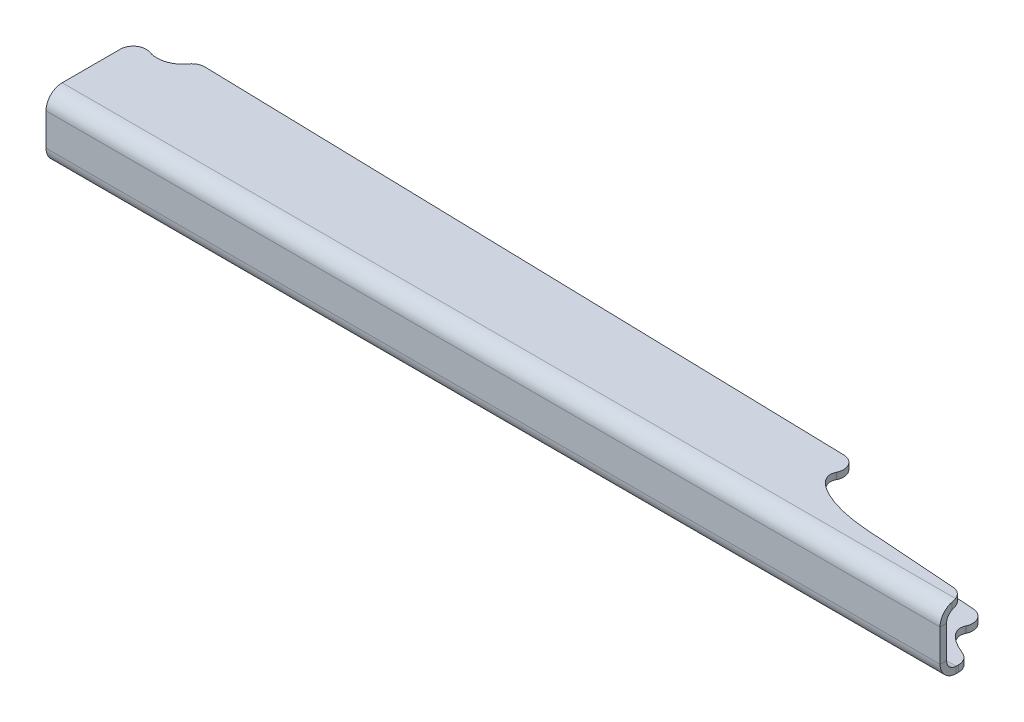
ISO-10303-21;
HEADER;
FILE_DESCRIPTION(('STEP AP214'),'2;1');
FILE_NAME('part.step','',(''),(''),'','','');
FILE_SCHEMA(('AUTOMOTIVE_DESIGN { 1 0 10303 214 1 1 1 1 }'));
ENDSEC;
DATA;
#1=APPLICATION_CONTEXT('core data for automotive mechanical design processes');
#2=APPLICATION_PROTOCOL_DEFINITION('international standard','automotive_design',2000,#1);
#3=PRODUCT_CONTEXT('',#1,'mechanical');
#4=PRODUCT('Part','Part','',(#3));
#5=PRODUCT_RELATED_PRODUCT_CATEGORY('part','',(#4));
#6=PRODUCT_DEFINITION_FORMATION('','',#4);
#7=PRODUCT_DEFINITION_CONTEXT('part definition',#1,'design');
#8=PRODUCT_DEFINITION('design','',#6,#7);
#9=PRODUCT_DEFINITION_SHAPE('','',#8);
#10=(LENGTH_UNIT() NAMED_UNIT(*) SI_UNIT(.MILLI.,.METRE.));
#11=(NAMED_UNIT(*) PLANE_ANGLE_UNIT() SI_UNIT($,.RADIAN.));
#12=(NAMED_UNIT(*) SI_UNIT($,.STERADIAN.) SOLID_ANGLE_UNIT());
#13=UNCERTAINTY_MEASURE_WITH_UNIT(LENGTH_MEASURE(1.E-05),#10,'distance_accuracy_value','');
#14=(GEOMETRIC_REPRESENTATION_CONTEXT(3) GLOBAL_UNCERTAINTY_ASSIGNED_CONTEXT((#13)) GLOBAL_UNIT_ASSIGNED_CONTEXT((#10,
#11,#12)) REPRESENTATION_CONTEXT('',''));
#15=CARTESIAN_POINT('',(0.,0.,0.));
#16=DIRECTION('',(0.,0.,1.));
#17=DIRECTION('',(1.,0.,0.));
#18=AXIS2_PLACEMENT_3D('',#15,#16,#17);
#19=CARTESIAN_POINT('',(176.197711918843,15.8750000000001,226.870352333592));
#20=DIRECTION('',(0.,-1.,0.));
#21=DIRECTION('',(0.997546498443055,0.,0.0700070242475666));
#22=AXIS2_PLACEMENT_3D('',#19,#20,#21);
#23=ELLIPSE('',#22,33.0952528110335,12.7);
#24=DIRECTION('',(0.,-1.,0.));
#25=VECTOR('',#24,1.);
#26=SURFACE_OF_LINEAR_EXTRUSION('',#23,#25);
#27=CARTESIAN_POINT('',(175.308622710899,15.875,239.539186009303));
#28=VERTEX_POINT('',#27);
#29=CARTESIAN_POINT('',(175.260174515592,15.875,239.535785953276));
#30=VERTEX_POINT('',#29);
#31=EDGE_CURVE('E291',#28,#30,#23,.T.);
#32=ORIENTED_EDGE('',*,*,#31,.F.);
#33=DIRECTION('',(0.,-1.,0.));
#34=VECTOR('',#33,1.);
#35=CARTESIAN_POINT('',(175.308622710899,15.875,239.539192863819));
#36=LINE('',#35,#34);
#37=CARTESIAN_POINT('',(175.308622710899,12.7,239.539192863819));
#38=VERTEX_POINT('',#37);
#39=EDGE_CURVE('E287',#28,#38,#36,.T.);
#40=ORIENTED_EDGE('',*,*,#39,.T.);
#41=CARTESIAN_POINT('',(176.197711918843,12.7000000000001,226.870352333592));
#42=DIRECTION('',(0.,-1.,0.));
#43=DIRECTION('',(0.997546498443055,0.,0.0700070242475666));
#44=AXIS2_PLACEMENT_3D('',#41,#42,#43);
#45=ELLIPSE('',#44,33.0952528110335,12.7);
#46=CARTESIAN_POINT('',(175.260174515592,12.7,239.535785953276));
#47=VERTEX_POINT('',#46);
#48=EDGE_CURVE('E296',#38,#47,#45,.T.);
#49=ORIENTED_EDGE('',*,*,#48,.T.);
#50=CARTESIAN_POINT('',(175.260174998121,12.7,239.535779132623));
#51=DIRECTION('',(0.,1.,0.));
#52=VECTOR('',#51,1.);
#53=LINE('',#50,#52);
#54=EDGE_CURVE('E336',#47,#30,#53,.T.);
#55=ORIENTED_EDGE('',*,*,#54,.T.);
#56=EDGE_LOOP('',(#32,#40,#49,#55));
#57=FACE_BOUND('',#56,.T.);
#58=ADVANCED_FACE('F44',(#57),#26,.F.);
#59=CARTESIAN_POINT('',(219.384237005619,-15.875,251.23487255075));
#60=DIRECTION('',(-1.,0.,0.));
#61=DIRECTION('',(0.,0.,1.));
#62=AXIS2_PLACEMENT_3D('',#59,#60,#61);
#63=PLANE('',#62);
#64=DIRECTION('',(0.,0.,1.));
#65=VECTOR('',#64,1.);
#66=CARTESIAN_POINT('',(219.384237005619,-15.875,251.23487255075));
#67=LINE('',#66,#65);
#68=CARTESIAN_POINT('',(219.384237005619,-15.875,245.310356735731));
#69=VERTEX_POINT('',#68);
#70=CARTESIAN_POINT('',(219.384237005619,-15.875,246.47237255075));
#71=VERTEX_POINT('',#70);
#72=EDGE_CURVE('E375',#69,#71,#67,.T.);
#73=ORIENTED_EDGE('',*,*,#72,.F.);
#74=DIRECTION('',(0.,1.,0.));
#75=VECTOR('',#74,1.);
#76=CARTESIAN_POINT('',(219.384237005619,-12.7,245.310356735731));
#77=LINE('',#76,#75);
#78=CARTESIAN_POINT('',(219.384237005619,-12.7,245.310356735731));
#79=VERTEX_POINT('',#78);
#80=EDGE_CURVE('E567',#69,#79,#77,.T.);
#81=ORIENTED_EDGE('',*,*,#80,.T.);
#82=DIRECTION('',(0.,0.,1.));
#83=VECTOR('',#82,1.);
#84=CARTESIAN_POINT('',(219.384237005619,-12.7,251.23487255075));
#85=LINE('',#84,#83);
#86=CARTESIAN_POINT('',(219.384237005619,-12.7,246.47237255075));
#87=VERTEX_POINT('',#86);
#88=EDGE_CURVE('E248',#79,#87,#85,.T.);
#89=ORIENTED_EDGE('',*,*,#88,.T.);
#90=DIRECTION('',(0.,-1.,0.));
#91=VECTOR('',#90,1.);
#92=CARTESIAN_POINT('',(219.384237005619,-12.7,246.47237255075));
#93=LINE('',#92,#91);
#94=EDGE_CURVE('E362',#87,#71,#93,.T.);
#95=ORIENTED_EDGE('',*,*,#94,.T.);
#96=EDGE_LOOP('',(#73,#81,#89,#95));
#97=FACE_BOUND('',#96,.T.);
#98=ADVANCED_FACE('F312',(#97),#63,.F.);
#99=CARTESIAN_POINT('',(0.,0.,254.40987255075));
#100=DIRECTION('',(0.,0.,-1.));
#101=DIRECTION('',(-1.,0.,0.));
#102=AXIS2_PLACEMENT_3D('',#99,#100,#101);
#103=PLANE('',#102);
#104=DIRECTION('',(-1.,0.,0.));
#105=VECTOR('',#104,1.);
#106=CARTESIAN_POINT('',(-219.384237005619,-7.93750000000003,254.40987255075));
#107=LINE('',#106,#105);
#108=CARTESIAN_POINT('',(-219.384237005619,-7.93750000000003,254.40987255075));
#109=VERTEX_POINT('',#108);
#110=CARTESIAN_POINT('',(219.384237005619,-7.93750000000003,254.40987255075));
#111=VERTEX_POINT('',#110);
#112=EDGE_CURVE('E381',#109,#111,#107,.F.);
#113=ORIENTED_EDGE('',*,*,#112,.T.);
#114=DIRECTION('',(0.,1.,0.));
#115=VECTOR('',#114,1.);
#116=CARTESIAN_POINT('',(219.384237005619,-12.7,254.40987255075));
#117=LINE('',#116,#115);
#118=CARTESIAN_POINT('',(219.384237005619,7.93750000000003,254.40987255075));
#119=VERTEX_POINT('',#118);
#120=EDGE_CURVE('E290',#111,#119,#117,.T.);
#121=ORIENTED_EDGE('',*,*,#120,.T.);
#122=DIRECTION('',(1.,0.,0.));
#123=VECTOR('',#122,1.);
#124=CARTESIAN_POINT('',(219.384237005619,7.93750000000003,254.40987255075));
#125=LINE('',#124,#123);
#126=CARTESIAN_POINT('',(-219.384237005619,7.93750000000003,254.40987255075));
#127=VERTEX_POINT('',#126);
#128=EDGE_CURVE('E417',#119,#127,#125,.F.);
#129=ORIENTED_EDGE('',*,*,#128,.T.);
#130=DIRECTION('',(0.,-1.,0.));
#131=VECTOR('',#130,1.);
#132=CARTESIAN_POINT('',(-219.384237005619,-12.7,254.40987255075));
#133=LINE('',#132,#131);
#134=EDGE_CURVE('E438',#127,#109,#133,.T.);
#135=ORIENTED_EDGE('',*,*,#134,.T.);
#136=EDGE_LOOP('',(#113,#121,#129,#135));
#137=FACE_BOUND('',#136,.T.);
#138=ADVANCED_FACE('F517',(#137),#103,.F.);
#139=CARTESIAN_POINT('',(0.,0.,251.23487255075));
#140=DIRECTION('',(0.,0.,-1.));
#141=DIRECTION('',(-1.,0.,0.));
#142=AXIS2_PLACEMENT_3D('',#139,#140,#141);
#143=PLANE('',#142);
#144=DIRECTION('',(0.,1.,0.));
#145=VECTOR('',#144,1.);
#146=CARTESIAN_POINT('',(219.384237005619,0.,251.23487255075));
#147=LINE('',#146,#145);
#148=CARTESIAN_POINT('',(219.384237005619,-7.93750000000003,251.23487255075));
#149=VERTEX_POINT('',#148);
#150=CARTESIAN_POINT('',(219.384237005619,7.93750000000003,251.23487255075));
#151=VERTEX_POINT('',#150);
#152=EDGE_CURVE('E440',#149,#151,#147,.T.);
#153=ORIENTED_EDGE('',*,*,#152,.F.);
#154=DIRECTION('',(-1.,0.,0.));
#155=VECTOR('',#154,1.);
#156=CARTESIAN_POINT('',(-219.384237005619,-7.93750000000003,251.23487255075));
#157=LINE('',#156,#155);
#158=CARTESIAN_POINT('',(-219.384237005619,-7.93750000000003,251.23487255075));
#159=VERTEX_POINT('',#158);
#160=EDGE_CURVE('E393',#159,#149,#157,.F.);
#161=ORIENTED_EDGE('',*,*,#160,.F.);
#162=DIRECTION('',(0.,1.,0.));
#163=VECTOR('',#162,1.);
#164=CARTESIAN_POINT('',(-219.384237005619,0.,251.23487255075));
#165=LINE('',#164,#163);
#166=CARTESIAN_POINT('',(-219.384237005619,7.93750000000003,251.23487255075));
#167=VERTEX_POINT('',#166);
#168=EDGE_CURVE('E435',#167,#159,#165,.F.);
#169=ORIENTED_EDGE('',*,*,#168,.F.);
#170=DIRECTION('',(1.,0.,0.));
#171=VECTOR('',#170,1.);
#172=CARTESIAN_POINT('',(219.384237005619,7.93750000000003,251.23487255075));
#173=LINE('',#172,#171);
#174=EDGE_CURVE('E428',#151,#167,#173,.F.);
#175=ORIENTED_EDGE('',*,*,#174,.F.);
#176=EDGE_LOOP('',(#153,#161,#169,#175));
#177=FACE_BOUND('',#176,.T.);
#178=ADVANCED_FACE('F453',(#177),#143,.T.);
#179=CARTESIAN_POINT('',(-219.384237005619,-12.7,254.40987255075));
#180=DIRECTION('',(1.,0.,0.));
#181=DIRECTION('',(0.,-1.,0.));
#182=AXIS2_PLACEMENT_3D('',#179,#180,#181);
#183=PLANE('',#182);
#184=ORIENTED_EDGE('',*,*,#168,.T.);
#185=DIRECTION('',(0.,0.,1.));
#186=VECTOR('',#185,1.);
#187=CARTESIAN_POINT('',(-219.384237005619,-7.93750000000003,251.23487255075));
#188=LINE('',#187,#186);
#189=EDGE_CURVE('E387',#159,#109,#188,.T.);
#190=ORIENTED_EDGE('',*,*,#189,.T.);
#191=ORIENTED_EDGE('',*,*,#134,.F.);
#192=DIRECTION('',(0.,0.,1.));
#193=VECTOR('',#192,1.);
#194=CARTESIAN_POINT('',(-219.384237005619,7.93750000000003,251.23487255075));
#195=LINE('',#194,#193);
#196=EDGE_CURVE('E432',#167,#127,#195,.T.);
#197=ORIENTED_EDGE('',*,*,#196,.F.);
#198=EDGE_LOOP('',(#184,#190,#191,#197));
#199=FACE_BOUND('',#198,.T.);
#200=ADVANCED_FACE('F523',(#199),#183,.F.);
#201=CARTESIAN_POINT('',(219.384237005619,-12.7,254.40987255075));
#202=DIRECTION('',(-1.,0.,0.));
#203=DIRECTION('',(0.,1.,0.));
#204=AXIS2_PLACEMENT_3D('',#201,#202,#203);
#205=PLANE('',#204);
#206=DIRECTION('',(0.,0.,1.));
#207=VECTOR('',#206,1.);
#208=CARTESIAN_POINT('',(219.384237005619,-7.93750000000003,251.23487255075));
#209=LINE('',#208,#207);
#210=EDGE_CURVE('E398',#149,#111,#209,.T.);
#211=ORIENTED_EDGE('',*,*,#210,.F.);
#212=ORIENTED_EDGE('',*,*,#152,.T.);
#213=DIRECTION('',(0.,0.,1.));
#214=VECTOR('',#213,1.);
#215=CARTESIAN_POINT('',(219.384237005619,7.93750000000003,251.23487255075));
#216=LINE('',#215,#214);
#217=EDGE_CURVE('E423',#151,#119,#216,.T.);
#218=ORIENTED_EDGE('',*,*,#217,.T.);
#219=ORIENTED_EDGE('',*,*,#120,.F.);
#220=EDGE_LOOP('',(#211,#212,#218,#219));
#221=FACE_BOUND('',#220,.T.);
#222=ADVANCED_FACE('F448',(#221),#205,.F.);
#223=CARTESIAN_POINT('',(-219.384237005619,7.93750000000003,246.47237255075));
#224=DIRECTION('',(-1.,0.,0.));
#225=DIRECTION('',(0.,0.,1.));
#226=AXIS2_PLACEMENT_3D('',#223,#224,#225);
#227=PLANE('',#226);
#228=DIRECTION('',(0.,1.,0.));
#229=VECTOR('',#228,1.);
#230=CARTESIAN_POINT('',(-219.384237005619,12.7,246.47237255075));
#231=LINE('',#230,#229);
#232=CARTESIAN_POINT('',(-219.384237005619,12.7,246.47237255075));
#233=VERTEX_POINT('',#232);
#234=CARTESIAN_POINT('',(-219.384237005619,15.875,246.47237255075));
#235=VERTEX_POINT('',#234);
#236=EDGE_CURVE('E401',#233,#235,#231,.T.);
#237=ORIENTED_EDGE('',*,*,#236,.F.);
#238=CARTESIAN_POINT('',(-219.384237005619,7.93750000000003,246.47237255075));
#239=DIRECTION('',(1.,0.,0.));
#240=DIRECTION('',(0.,0.,-1.));
#241=AXIS2_PLACEMENT_3D('',#238,#239,#240);
#242=CIRCLE('',#241,4.76249999999999);
#243=EDGE_CURVE('E425',#167,#233,#242,.F.);
#244=ORIENTED_EDGE('',*,*,#243,.F.);
#245=ORIENTED_EDGE('',*,*,#196,.T.);
#246=CARTESIAN_POINT('',(-219.384237005619,7.93750000000003,246.47237255075));
#247=DIRECTION('',(1.,0.,0.));
#248=DIRECTION('',(0.,0.,-1.));
#249=AXIS2_PLACEMENT_3D('',#246,#247,#248);
#250=CIRCLE('',#249,7.93749999999999);
#251=EDGE_CURVE('E419',#127,#235,#250,.F.);
#252=ORIENTED_EDGE('',*,*,#251,.T.);
#253=EDGE_LOOP('',(#237,#244,#245,#252));
#254=FACE_BOUND('',#253,.T.);
#255=ADVANCED_FACE('F511',(#254),#227,.T.);
#256=CARTESIAN_POINT('',(219.384237005619,7.93750000000003,246.47237255075));
#257=DIRECTION('',(-1.,0.,0.));
#258=DIRECTION('',(0.,0.,1.));
#259=AXIS2_PLACEMENT_3D('',#256,#257,#258);
#260=PLANE('',#259);
#261=CARTESIAN_POINT('',(219.384237005619,7.93750000000003,246.47237255075));
#262=DIRECTION('',(1.,0.,0.));
#263=DIRECTION('',(0.,0.,-1.));
#264=AXIS2_PLACEMENT_3D('',#261,#262,#263);
#265=CIRCLE('',#264,4.76249999999999);
#266=CARTESIAN_POINT('',(219.384237005619,12.2217814411415,248.552357835095));
#267=VERTEX_POINT('',#266);
#268=EDGE_CURVE('E415',#267,#151,#265,.T.);
#269=ORIENTED_EDGE('',*,*,#268,.F.);
#270=DIRECTION('',(0.,-1.,0.));
#271=VECTOR('',#270,1.);
#272=CARTESIAN_POINT('',(219.384237005619,15.8750000000001,248.552357835095));
#273=LINE('',#272,#271);
#274=CARTESIAN_POINT('',(219.384237005619,15.5976284236565,248.552357835095));
#275=VERTEX_POINT('',#274);
#276=EDGE_CURVE('E461',#267,#275,#273,.F.);
#277=ORIENTED_EDGE('',*,*,#276,.T.);
#278=CARTESIAN_POINT('',(219.384237005619,7.93750000000003,246.47237255075));
#279=DIRECTION('',(1.,0.,0.));
#280=DIRECTION('',(0.,0.,-1.));
#281=AXIS2_PLACEMENT_3D('',#278,#279,#280);
#282=CIRCLE('',#281,7.93749999999999);
#283=EDGE_CURVE('E420',#275,#119,#282,.T.);
#284=ORIENTED_EDGE('',*,*,#283,.T.);
#285=ORIENTED_EDGE('',*,*,#217,.F.);
#286=EDGE_LOOP('',(#269,#277,#284,#285));
#287=FACE_BOUND('',#286,.T.);
#288=ADVANCED_FACE('F458',(#287),#260,.F.);
#289=CARTESIAN_POINT('',(219.384237005619,7.93750000000003,246.47237255075));
#290=DIRECTION('',(1.,0.,0.));
#291=DIRECTION('',(0.,1.,0.));
#292=AXIS2_PLACEMENT_3D('',#289,#290,#291);
#293=CYLINDRICAL_SURFACE('',#292,7.93749999999999);
#294=ORIENTED_EDGE('',*,*,#283,.F.);
#295=CARTESIAN_POINT('',(219.384237005619,15.5976284236565,248.552357835095));
#296=CARTESIAN_POINT('',(219.384264996326,15.6352887334146,248.41377608777));
#297=CARTESIAN_POINT('',(219.379701384491,15.6691364681828,248.274141636719));
#298=CARTESIAN_POINT('',(219.361174167291,15.7291422309625,247.99377112524));
#299=CARTESIAN_POINT('',(219.347205534562,15.7552961355601,247.853034515451));
#300=CARTESIAN_POINT('',(219.30998073337,15.7994183835176,247.574084964663));
#301=CARTESIAN_POINT('',(219.286891963162,15.8175224020565,247.435871105136));
#302=CARTESIAN_POINT('',(219.231433570082,15.8463143043339,247.160618676665));
#303=CARTESIAN_POINT('',(219.199070138114,15.8570071188834,247.023579386322));
#304=CARTESIAN_POINT('',(219.143204458094,15.867782266984,246.817929678283));
#305=CARTESIAN_POINT('',(219.123069399117,15.8704959599045,246.748515919373));
#306=CARTESIAN_POINT('',(219.08032979249,15.8741093359709,246.610056270426));
#307=CARTESIAN_POINT('',(219.057714353504,15.8750006512596,246.541013522791));
#308=CARTESIAN_POINT('',(219.0339170985,15.875,246.47237255075));
#309=B_SPLINE_CURVE_WITH_KNOTS('',3,(#295,#296,#297,#298,#299,#300,#301,#302,#303,#304,#305,
#306,#307,#308),.UNSPECIFIED.,.F.,.F.,(4,2,2,2,2,2,4),(0.,0.430722182565064,0.861674786593532,
1.28505978139482,1.70816281923735,1.92508435726537,2.14299972258811),.UNSPECIFIED.);
#310=CARTESIAN_POINT('',(219.0339170985,15.875,246.47237255075));
#311=VERTEX_POINT('',#310);
#312=EDGE_CURVE('E466',#275,#311,#309,.T.);
#313=ORIENTED_EDGE('',*,*,#312,.T.);
#314=DIRECTION('',(-1.,0.,0.));
#315=VECTOR('',#314,1.);
#316=CARTESIAN_POINT('',(0.,15.875,246.47237255075));
#317=LINE('',#316,#315);
#318=EDGE_CURVE('E407',#311,#235,#317,.T.);
#319=ORIENTED_EDGE('',*,*,#318,.T.);
#320=ORIENTED_EDGE('',*,*,#251,.F.);
#321=ORIENTED_EDGE('',*,*,#128,.F.);
#322=EDGE_LOOP('',(#294,#313,#319,#320,#321));
#323=FACE_BOUND('',#322,.T.);
#324=ADVANCED_FACE('F465',(#323),#293,.T.);
#325=CARTESIAN_POINT('',(219.384237005619,7.93750000000003,246.47237255075));
#326=DIRECTION('',(1.,0.,0.));
#327=DIRECTION('',(0.,1.,0.));
#328=AXIS2_PLACEMENT_3D('',#325,#326,#327);
#329=CYLINDRICAL_SURFACE('',#328,4.76249999999999);
#330=DIRECTION('',(1.,0.,0.));
#331=VECTOR('',#330,1.);
#332=CARTESIAN_POINT('',(-219.384237005619,12.7,246.47237255075));
#333=LINE('',#332,#331);
#334=CARTESIAN_POINT('',(219.0339170985,12.7,246.47237255075));
#335=VERTEX_POINT('',#334);
#336=EDGE_CURVE('E404',#233,#335,#333,.T.);
#337=ORIENTED_EDGE('',*,*,#336,.T.);
#338=CARTESIAN_POINT('',(219.0339170985,12.7,246.47237255075));
#339=CARTESIAN_POINT('',(219.07068558409,12.7000201432615,246.578361826147));
#340=CARTESIAN_POINT('',(219.104608748737,12.696462145525,246.685355313597));
#341=CARTESIAN_POINT('',(219.166652497087,12.6819336044352,246.900556063539));
#342=CARTESIAN_POINT('',(219.194770905764,12.6709602891416,247.00876376504));
#343=CARTESIAN_POINT('',(219.244482385859,12.6416878266099,247.223004664771));
#344=CARTESIAN_POINT('',(219.266211650407,12.6235644545484,247.329030102591));
#345=CARTESIAN_POINT('',(219.304021131823,12.5799297723705,247.540506015227));
#346=CARTESIAN_POINT('',(219.320103660699,12.5544214937665,247.645956707915));
#347=CARTESIAN_POINT('',(219.350747382918,12.4873056902437,247.886794660234));
#348=CARTESIAN_POINT('',(219.363425493606,12.4431657039896,248.021734033288));
#349=CARTESIAN_POINT('',(219.376003785007,12.367527890703,248.222080444876));
#350=CARTESIAN_POINT('',(219.379121815721,12.3404971336086,248.28902868113));
#351=CARTESIAN_POINT('',(219.383238620766,12.283399932278,248.421672491737));
#352=CARTESIAN_POINT('',(219.384237726659,12.253333963754,248.487368260478));
#353=CARTESIAN_POINT('',(219.384237005619,12.2217814411415,248.552357835095));
#354=B_SPLINE_CURVE_WITH_KNOTS('',3,(#338,#339,#340,#341,#342,#343,#344,#345,#346,#347,#348,
#349,#350,#351,#352,#353),.UNSPECIFIED.,.F.,.F.,(4,2,2,2,2,2,2,4),(0.,0.336484423139228,
0.673094698084064,1.00189949859138,1.33056951527293,1.75722851688728,1.97393927607947,
2.19061612252963),.UNSPECIFIED.);
#355=EDGE_CURVE('E478',#335,#267,#354,.T.);
#356=ORIENTED_EDGE('',*,*,#355,.T.);
#357=ORIENTED_EDGE('',*,*,#268,.T.);
#358=ORIENTED_EDGE('',*,*,#174,.T.);
#359=ORIENTED_EDGE('',*,*,#243,.T.);
#360=EDGE_LOOP('',(#337,#356,#357,#358,#359));
#361=FACE_BOUND('',#360,.T.);
#362=ADVANCED_FACE('F506',(#361),#329,.F.);
#363=CARTESIAN_POINT('',(-219.384237005619,15.875,251.23487255075));
#364=DIRECTION('',(1.,0.,0.));
#365=DIRECTION('',(0.,0.,-1.));
#366=AXIS2_PLACEMENT_3D('',#363,#364,#365);
#367=PLANE('',#366);
#368=DIRECTION('',(0.,0.,1.));
#369=VECTOR('',#368,1.);
#370=CARTESIAN_POINT('',(-219.384237005619,15.875,251.23487255075));
#371=LINE('',#370,#369);
#372=CARTESIAN_POINT('',(-219.384237005619,15.8750000000001,217.960512242136));
#373=VERTEX_POINT('',#372);
#374=EDGE_CURVE('E413',#373,#235,#371,.T.);
#375=ORIENTED_EDGE('',*,*,#374,.F.);
#376=DIRECTION('',(0.,1.,0.));
#377=VECTOR('',#376,1.);
#378=CARTESIAN_POINT('',(-219.384237005619,15.875,217.960512242136));
#379=LINE('',#378,#377);
#380=CARTESIAN_POINT('',(-219.384237005619,12.7000000000001,217.960512242136));
#381=VERTEX_POINT('',#380);
#382=EDGE_CURVE('E597',#373,#381,#379,.F.);
#383=ORIENTED_EDGE('',*,*,#382,.T.);
#384=DIRECTION('',(0.,0.,1.));
#385=VECTOR('',#384,1.);
#386=CARTESIAN_POINT('',(-219.384237005619,12.7,251.23487255075));
#387=LINE('',#386,#385);
#388=EDGE_CURVE('E412',#381,#233,#387,.T.);
#389=ORIENTED_EDGE('',*,*,#388,.T.);
#390=ORIENTED_EDGE('',*,*,#236,.T.);
#391=EDGE_LOOP('',(#375,#383,#389,#390));
#392=FACE_BOUND('',#391,.T.);
#393=ADVANCED_FACE('F510',(#392),#367,.F.);
#394=CARTESIAN_POINT('',(0.,15.8750000000009,0.));
#395=DIRECTION('',(0.,-1.,0.));
#396=DIRECTION('',(0.,0.,-1.));
#397=AXIS2_PLACEMENT_3D('',#394,#395,#396);
#398=PLANE('',#397);
#399=CARTESIAN_POINT('',(-206.684237005619,15.8750000000002,199.999999999998));
#400=DIRECTION('',(0.,-1.,0.));
#401=DIRECTION('',(0.,0.,-1.));
#402=AXIS2_PLACEMENT_3D('',#399,#400,#401);
#403=CIRCLE('',#402,12.7);
#404=CARTESIAN_POINT('',(-196.347853642224,15.8750000000002,207.378968692501));
#405=VERTEX_POINT('',#404);
#406=CARTESIAN_POINT('',(-210.917570338952,15.8750000000001,211.97367482809));
#407=VERTEX_POINT('',#406);
#408=EDGE_CURVE('E302',#405,#407,#403,.T.);
#409=ORIENTED_EDGE('',*,*,#408,.T.);
#410=CARTESIAN_POINT('',(-213.034237005619,15.8750000000001,217.960512242136));
#411=DIRECTION('',(0.,-1.,0.));
#412=DIRECTION('',(0.,0.,-1.));
#413=AXIS2_PLACEMENT_3D('',#410,#411,#412);
#414=CIRCLE('',#413,6.35);
#415=EDGE_CURVE('E11',#407,#373,#414,.F.);
#416=ORIENTED_EDGE('',*,*,#415,.T.);
#417=ORIENTED_EDGE('',*,*,#374,.T.);
#418=ORIENTED_EDGE('',*,*,#318,.F.);
#419=CARTESIAN_POINT('',(213.034237005619,15.875,248.552357835095));
#420=DIRECTION('',(0.,-1.,0.));
#421=DIRECTION('',(0.,0.,-1.));
#422=AXIS2_PLACEMENT_3D('',#419,#420,#421);
#423=CIRCLE('',#422,6.35);
#424=CARTESIAN_POINT('',(213.478781609591,15.875,242.217937569982));
#425=VERTEX_POINT('',#424);
#426=EDGE_CURVE('E276',#311,#425,#423,.F.);
#427=ORIENTED_EDGE('',*,*,#426,.T.);
#428=DIRECTION('',(-0.997546498443055,0.,-0.0700070242475656));
#429=VECTOR('',#428,1.);
#430=CARTESIAN_POINT('',(-15.8690971338724,15.8750000000001,226.122484843336));
#431=LINE('',#430,#429);
#432=EDGE_CURVE('E264',#425,#28,#431,.T.);
#433=ORIENTED_EDGE('',*,*,#432,.T.);
#434=ORIENTED_EDGE('',*,*,#31,.T.);
#435=DIRECTION('',(-0.997546498443055,0.,-0.0700070242475666));
#436=VECTOR('',#435,1.);
#437=CARTESIAN_POINT('',(-207.573326213563,15.8750000000001,212.668840530223));
#438=LINE('',#437,#436);
#439=CARTESIAN_POINT('',(167.638543243899,15.875,239.000905898987));
#440=VERTEX_POINT('',#439);
#441=EDGE_CURVE('E294',#30,#440,#438,.T.);
#442=ORIENTED_EDGE('',*,*,#441,.T.);
#443=CARTESIAN_POINT('',(168.576080647149,15.8750000000001,226.335472279303));
#444=DIRECTION('',(0.,-1.,0.));
#445=DIRECTION('',(0.997546498443055,0.,0.0700070242475666));
#446=AXIS2_PLACEMENT_3D('',#443,#444,#445);
#447=ELLIPSE('',#446,33.0952528110335,12.7);
#448=CARTESIAN_POINT('',(136.115857400997,15.8750000000001,222.048652749712));
#449=VERTEX_POINT('',#448);
#450=EDGE_CURVE('E304',#440,#449,#447,.T.);
#451=ORIENTED_EDGE('',*,*,#450,.T.);
#452=CARTESIAN_POINT('',(130.439006651861,15.8750000000001,219.203329293226));
#453=DIRECTION('',(0.,-1.,0.));
#454=DIRECTION('',(0.,0.,-1.));
#455=AXIS2_PLACEMENT_3D('',#452,#453,#454);
#456=CIRCLE('',#455,6.35);
#457=CARTESIAN_POINT('',(130.599569309511,15.8750000000001,212.855359567954));
#458=VERTEX_POINT('',#457);
#459=EDGE_CURVE('E274',#449,#458,#456,.F.);
#460=ORIENTED_EDGE('',*,*,#459,.T.);
#461=DIRECTION('',(-0.99968027169636,0.,-0.0252854578976266));
#462=VECTOR('',#461,1.);
#463=CARTESIAN_POINT('',(-5.29692500166766,15.8750000000001,209.418055479208));
#464=LINE('',#463,#462);
#465=CARTESIAN_POINT('',(-191.019099302876,15.8750000000002,204.72048331348));
#466=VERTEX_POINT('',#465);
#467=EDGE_CURVE('E261',#458,#466,#464,.T.);
#468=ORIENTED_EDGE('',*,*,#467,.T.);
#469=CARTESIAN_POINT('',(-191.179661960526,15.8750000000001,211.068453038752));
#470=DIRECTION('',(0.,-1.,0.));
#471=DIRECTION('',(0.,0.,-1.));
#472=AXIS2_PLACEMENT_3D('',#469,#470,#471);
#473=CIRCLE('',#472,6.35);
#474=EDGE_CURVE('E278',#466,#405,#473,.F.);
#475=ORIENTED_EDGE('',*,*,#474,.T.);
#476=EDGE_LOOP('',(#409,#416,#417,#418,#427,#433,#434,#442,#451,#460,#468,#475));
#477=FACE_BOUND('',#476,.T.);
#478=ADVANCED_FACE('F590',(#477),#398,.F.);
#479=CARTESIAN_POINT('',(0.,12.7000000000009,0.));
#480=DIRECTION('',(0.,-1.,0.));
#481=DIRECTION('',(0.,0.,-1.));
#482=AXIS2_PLACEMENT_3D('',#479,#480,#481);
#483=PLANE('',#482);
#484=ORIENTED_EDGE('',*,*,#388,.F.);
#485=CARTESIAN_POINT('',(-213.034237005619,12.7000000000001,217.960512242136));
#486=DIRECTION('',(0.,-1.,0.));
#487=DIRECTION('',(0.,0.,-1.));
#488=AXIS2_PLACEMENT_3D('',#485,#486,#487);
#489=CIRCLE('',#488,6.35);
#490=CARTESIAN_POINT('',(-210.917570338952,12.7000000000001,211.97367482809));
#491=VERTEX_POINT('',#490);
#492=EDGE_CURVE('E66',#381,#491,#489,.T.);
#493=ORIENTED_EDGE('',*,*,#492,.T.);
#494=CARTESIAN_POINT('',(-206.684237005619,12.7000000000002,199.999999999998));
#495=DIRECTION('',(0.,-1.,0.));
#496=DIRECTION('',(0.,0.,-1.));
#497=AXIS2_PLACEMENT_3D('',#494,#495,#496);
#498=CIRCLE('',#497,12.7);
#499=CARTESIAN_POINT('',(-196.347853642224,12.7000000000002,207.378968692501));
#500=VERTEX_POINT('',#499);
#501=EDGE_CURVE('E640',#500,#491,#498,.T.);
#502=ORIENTED_EDGE('',*,*,#501,.F.);
#503=CARTESIAN_POINT('',(-191.179661960526,12.7000000000001,211.068453038752));
#504=DIRECTION('',(0.,-1.,0.));
#505=DIRECTION('',(0.,0.,-1.));
#506=AXIS2_PLACEMENT_3D('',#503,#504,#505);
#507=CIRCLE('',#506,6.35);
#508=CARTESIAN_POINT('',(-191.019099302876,12.7000000000002,204.72048331348));
#509=VERTEX_POINT('',#508);
#510=EDGE_CURVE('E598',#500,#509,#507,.T.);
#511=ORIENTED_EDGE('',*,*,#510,.T.);
#512=DIRECTION('',(-0.99968027169636,0.,-0.0252854578976267));
#513=VECTOR('',#512,1.);
#514=CARTESIAN_POINT('',(-5.29692500166766,12.7000000000001,209.418055479209));
#515=LINE('',#514,#513);
#516=CARTESIAN_POINT('',(130.599569309511,12.7000000000001,212.855359567954));
#517=VERTEX_POINT('',#516);
#518=EDGE_CURVE('E254',#517,#509,#515,.T.);
#519=ORIENTED_EDGE('',*,*,#518,.F.);
#520=CARTESIAN_POINT('',(130.439006651861,12.7000000000001,219.203329293226));
#521=DIRECTION('',(0.,-1.,0.));
#522=DIRECTION('',(0.,0.,-1.));
#523=AXIS2_PLACEMENT_3D('',#520,#521,#522);
#524=CIRCLE('',#523,6.35);
#525=CARTESIAN_POINT('',(136.115857400997,12.7000000000001,222.048652749712));
#526=VERTEX_POINT('',#525);
#527=EDGE_CURVE('E280',#517,#526,#524,.T.);
#528=ORIENTED_EDGE('',*,*,#527,.T.);
#529=CARTESIAN_POINT('',(168.576080647149,12.7000000000001,226.335472279303));
#530=DIRECTION('',(0.,-1.,0.));
#531=DIRECTION('',(0.997546498443055,0.,0.0700070242475666));
#532=AXIS2_PLACEMENT_3D('',#529,#530,#531);
#533=ELLIPSE('',#532,33.0952528110335,12.7);
#534=CARTESIAN_POINT('',(167.638543243899,12.7,239.000905898987));
#535=VERTEX_POINT('',#534);
#536=EDGE_CURVE('E295',#535,#526,#533,.T.);
#537=ORIENTED_EDGE('',*,*,#536,.F.);
#538=DIRECTION('',(-0.997546498443055,0.,-0.0700070242475687));
#539=VECTOR('',#538,1.);
#540=CARTESIAN_POINT('',(175.260174033064,12.7,239.535792773929));
#541=LINE('',#540,#539);
#542=EDGE_CURVE('E350',#47,#535,#541,.T.);
#543=ORIENTED_EDGE('',*,*,#542,.F.);
#544=ORIENTED_EDGE('',*,*,#48,.F.);
#545=DIRECTION('',(-0.997546498443055,0.,-0.0700070242475656));
#546=VECTOR('',#545,1.);
#547=CARTESIAN_POINT('',(-15.8690971338724,12.7000000000001,226.122484843336));
#548=LINE('',#547,#546);
#549=CARTESIAN_POINT('',(213.478781609591,12.7,242.217937569982));
#550=VERTEX_POINT('',#549);
#551=EDGE_CURVE('E257',#550,#38,#548,.T.);
#552=ORIENTED_EDGE('',*,*,#551,.F.);
#553=CARTESIAN_POINT('',(213.034237005619,12.7,248.552357835095));
#554=DIRECTION('',(0.,-1.,0.));
#555=DIRECTION('',(0.,0.,-1.));
#556=AXIS2_PLACEMENT_3D('',#553,#554,#555);
#557=CIRCLE('',#556,6.35);
#558=EDGE_CURVE('E586',#550,#335,#557,.T.);
#559=ORIENTED_EDGE('',*,*,#558,.T.);
#560=ORIENTED_EDGE('',*,*,#336,.F.);
#561=EDGE_LOOP('',(#484,#493,#502,#511,#519,#528,#537,#543,#544,#552,#559,#560));
#562=FACE_BOUND('',#561,.T.);
#563=ADVANCED_FACE('F584',(#562),#483,.T.);
#564=CARTESIAN_POINT('',(219.384237005619,-7.93750000000003,246.47237255075));
#565=DIRECTION('',(1.,0.,0.));
#566=DIRECTION('',(0.,0.,-1.));
#567=AXIS2_PLACEMENT_3D('',#564,#565,#566);
#568=PLANE('',#567);
#569=ORIENTED_EDGE('',*,*,#94,.F.);
#570=CARTESIAN_POINT('',(219.384237005619,-7.93750000000003,246.47237255075));
#571=DIRECTION('',(-1.,0.,0.));
#572=DIRECTION('',(0.,0.,1.));
#573=AXIS2_PLACEMENT_3D('',#570,#571,#572);
#574=CIRCLE('',#573,4.76249999999999);
#575=EDGE_CURVE('E390',#149,#87,#574,.F.);
#576=ORIENTED_EDGE('',*,*,#575,.F.);
#577=ORIENTED_EDGE('',*,*,#210,.T.);
#578=CARTESIAN_POINT('',(219.384237005619,-7.93750000000003,246.47237255075));
#579=DIRECTION('',(-1.,0.,0.));
#580=DIRECTION('',(0.,0.,1.));
#581=AXIS2_PLACEMENT_3D('',#578,#579,#580);
#582=CIRCLE('',#581,7.93749999999999);
#583=EDGE_CURVE('E383',#111,#71,#582,.F.);
#584=ORIENTED_EDGE('',*,*,#583,.T.);
#585=EDGE_LOOP('',(#569,#576,#577,#584));
#586=FACE_BOUND('',#585,.T.);
#587=ADVANCED_FACE('F665',(#586),#568,.T.);
#588=CARTESIAN_POINT('',(-219.384237005619,-7.93750000000003,246.47237255075));
#589=DIRECTION('',(1.,0.,0.));
#590=DIRECTION('',(0.,0.,-1.));
#591=AXIS2_PLACEMENT_3D('',#588,#589,#590);
#592=PLANE('',#591);
#593=CARTESIAN_POINT('',(-219.384237005619,-7.93750000000003,246.47237255075));
#594=DIRECTION('',(-1.,0.,0.));
#595=DIRECTION('',(0.,0.,1.));
#596=AXIS2_PLACEMENT_3D('',#593,#594,#595);
#597=CIRCLE('',#596,4.76249999999999);
#598=CARTESIAN_POINT('',(-219.384237005619,-12.7,246.47237255075));
#599=VERTEX_POINT('',#598);
#600=EDGE_CURVE('E377',#599,#159,#597,.T.);
#601=ORIENTED_EDGE('',*,*,#600,.F.);
#602=DIRECTION('',(0.,-1.,0.));
#603=VECTOR('',#602,1.);
#604=CARTESIAN_POINT('',(-219.384237005619,-12.7,246.47237255075));
#605=LINE('',#604,#603);
#606=CARTESIAN_POINT('',(-219.384237005619,-15.875,246.47237255075));
#607=VERTEX_POINT('',#606);
#608=EDGE_CURVE('E361',#599,#607,#605,.T.);
#609=ORIENTED_EDGE('',*,*,#608,.T.);
#610=CARTESIAN_POINT('',(-219.384237005619,-7.93750000000003,246.47237255075));
#611=DIRECTION('',(-1.,0.,0.));
#612=DIRECTION('',(0.,0.,1.));
#613=AXIS2_PLACEMENT_3D('',#610,#611,#612);
#614=CIRCLE('',#613,7.93749999999999);
#615=EDGE_CURVE('E384',#607,#109,#614,.T.);
#616=ORIENTED_EDGE('',*,*,#615,.T.);
#617=ORIENTED_EDGE('',*,*,#189,.F.);
#618=EDGE_LOOP('',(#601,#609,#616,#617));
#619=FACE_BOUND('',#618,.T.);
#620=ADVANCED_FACE('F656',(#619),#592,.F.);
#621=CARTESIAN_POINT('',(-219.384237005619,-7.93750000000003,246.47237255075));
#622=DIRECTION('',(-1.,0.,0.));
#623=DIRECTION('',(0.,-1.,0.));
#624=AXIS2_PLACEMENT_3D('',#621,#622,#623);
#625=CYLINDRICAL_SURFACE('',#624,7.93749999999999);
#626=ORIENTED_EDGE('',*,*,#112,.F.);
#627=ORIENTED_EDGE('',*,*,#615,.F.);
#628=DIRECTION('',(1.,0.,0.));
#629=VECTOR('',#628,1.);
#630=CARTESIAN_POINT('',(0.,-15.875,246.47237255075));
#631=LINE('',#630,#629);
#632=EDGE_CURVE('E365',#607,#71,#631,.T.);
#633=ORIENTED_EDGE('',*,*,#632,.T.);
#634=ORIENTED_EDGE('',*,*,#583,.F.);
#635=EDGE_LOOP('',(#626,#627,#633,#634));
#636=FACE_BOUND('',#635,.T.);
#637=ADVANCED_FACE('F662',(#636),#625,.T.);
#638=CARTESIAN_POINT('',(-219.384237005619,-7.93750000000003,246.47237255075));
#639=DIRECTION('',(-1.,0.,0.));
#640=DIRECTION('',(0.,-1.,0.));
#641=AXIS2_PLACEMENT_3D('',#638,#639,#640);
#642=CYLINDRICAL_SURFACE('',#641,4.76249999999999);
#643=ORIENTED_EDGE('',*,*,#160,.T.);
#644=ORIENTED_EDGE('',*,*,#575,.T.);
#645=DIRECTION('',(-1.,0.,0.));
#646=VECTOR('',#645,1.);
#647=CARTESIAN_POINT('',(219.384237005619,-12.7,246.47237255075));
#648=LINE('',#647,#646);
#649=EDGE_CURVE('E359',#87,#599,#648,.T.);
#650=ORIENTED_EDGE('',*,*,#649,.T.);
#651=ORIENTED_EDGE('',*,*,#600,.T.);
#652=EDGE_LOOP('',(#643,#644,#650,#651));
#653=FACE_BOUND('',#652,.T.);
#654=ADVANCED_FACE('F671',(#653),#642,.F.);
#655=CARTESIAN_POINT('',(-219.384237005619,-15.8750000000002,199.999999999998));
#656=DIRECTION('',(1.,0.,0.));
#657=DIRECTION('',(0.,0.,-1.));
#658=AXIS2_PLACEMENT_3D('',#655,#656,#657);
#659=PLANE('',#658);
#660=DIRECTION('',(0.,0.,-1.));
#661=VECTOR('',#660,1.);
#662=CARTESIAN_POINT('',(-219.384237005619,-12.7000000000002,199.999999999998));
#663=LINE('',#662,#661);
#664=CARTESIAN_POINT('',(-219.384237005619,-12.7000000000001,217.960512242136));
#665=VERTEX_POINT('',#664);
#666=EDGE_CURVE('E249',#599,#665,#663,.T.);
#667=ORIENTED_EDGE('',*,*,#666,.T.);
#668=DIRECTION('',(0.,1.,0.));
#669=VECTOR('',#668,1.);
#670=CARTESIAN_POINT('',(-219.384237005619,-15.8750000000002,217.960512242136));
#671=LINE('',#670,#669);
#672=CARTESIAN_POINT('',(-219.384237005619,-15.8750000000001,217.960512242136));
#673=VERTEX_POINT('',#672);
#674=EDGE_CURVE('E547',#665,#673,#671,.F.);
#675=ORIENTED_EDGE('',*,*,#674,.T.);
#676=DIRECTION('',(0.,0.,-1.));
#677=VECTOR('',#676,1.);
#678=CARTESIAN_POINT('',(-219.384237005619,-15.8750000000002,199.999999999998));
#679=LINE('',#678,#677);
#680=EDGE_CURVE('E370',#607,#673,#679,.T.);
#681=ORIENTED_EDGE('',*,*,#680,.F.);
#682=ORIENTED_EDGE('',*,*,#608,.F.);
#683=EDGE_LOOP('',(#667,#675,#681,#682));
#684=FACE_BOUND('',#683,.T.);
#685=ADVANCED_FACE('F651',(#684),#659,.F.);
#686=CARTESIAN_POINT('',(0.,-15.8750000000009,0.));
#687=DIRECTION('',(0.,1.,0.));
#688=DIRECTION('',(0.,0.,1.));
#689=AXIS2_PLACEMENT_3D('',#686,#687,#688);
#690=PLANE('',#689);
#691=CARTESIAN_POINT('',(-206.684237005619,-15.8750000000002,199.999999999998));
#692=DIRECTION('',(0.,1.,0.));
#693=DIRECTION('',(0.,0.,1.));
#694=AXIS2_PLACEMENT_3D('',#691,#692,#693);
#695=CIRCLE('',#694,12.7);
#696=CARTESIAN_POINT('',(-210.917570338952,-15.8750000000002,211.97367482809));
#697=VERTEX_POINT('',#696);
#698=CARTESIAN_POINT('',(-194.710562177527,-15.8750000000002,204.233333333332));
#699=VERTEX_POINT('',#698);
#700=EDGE_CURVE('E267',#697,#699,#695,.T.);
#701=ORIENTED_EDGE('',*,*,#700,.T.);
#702=CARTESIAN_POINT('',(-188.72372476348,-15.8750000000002,206.349999999998));
#703=DIRECTION('',(0.,1.,0.));
#704=DIRECTION('',(0.,0.,1.));
#705=AXIS2_PLACEMENT_3D('',#702,#703,#704);
#706=CIRCLE('',#705,6.35);
#707=CARTESIAN_POINT('',(-188.72372476348,-15.8750000000002,199.999999999998));
#708=VERTEX_POINT('',#707);
#709=EDGE_CURVE('E553',#699,#708,#706,.F.);
#710=ORIENTED_EDGE('',*,*,#709,.T.);
#711=DIRECTION('',(1.,0.,0.));
#712=VECTOR('',#711,1.);
#713=CARTESIAN_POINT('',(219.384237005619,-15.8750000000002,199.999999999998));
#714=LINE('',#713,#712);
#715=CARTESIAN_POINT('',(-56.5158778235348,-15.8750000000002,199.999999999998));
#716=VERTEX_POINT('',#715);
#717=EDGE_CURVE('E373',#708,#716,#714,.T.);
#718=ORIENTED_EDGE('',*,*,#717,.T.);
#719=DIRECTION('',(-0.997546498443055,0.,-0.0700070242475653));
#720=VECTOR('',#719,1.);
#721=CARTESIAN_POINT('',(219.384237005619,-15.8750000000001,219.362451834471));
#722=LINE('',#721,#720);
#723=CARTESIAN_POINT('',(199.345453001991,-15.8750000000001,217.956145822848));
#724=VERTEX_POINT('',#723);
#725=EDGE_CURVE('E238',#724,#716,#722,.T.);
#726=ORIENTED_EDGE('',*,*,#725,.F.);
#727=CARTESIAN_POINT('',(198.900908398019,-15.8750000000001,224.290566087962));
#728=DIRECTION('',(0.,1.,0.));
#729=DIRECTION('',(0.,0.,1.));
#730=AXIS2_PLACEMENT_3D('',#727,#728,#729);
#731=CIRCLE('',#730,6.35);
#732=CARTESIAN_POINT('',(204.646640781998,-15.8750000000001,226.994093297312));
#733=VERTEX_POINT('',#732);
#734=EDGE_CURVE('E558',#724,#733,#731,.F.);
#735=ORIENTED_EDGE('',*,*,#734,.T.);
#736=CARTESIAN_POINT('',(237.170762092394,-15.8750000000001,231.149392767908));
#737=DIRECTION('',(0.,-1.,0.));
#738=DIRECTION('',(0.997546498443056,0.,0.0700070242475637));
#739=AXIS2_PLACEMENT_3D('',#736,#737,#738);
#740=ELLIPSE('',#739,33.0952528110335,12.7);
#741=CARTESIAN_POINT('',(215.382826120749,-15.875,239.410642406351));
#742=VERTEX_POINT('',#741);
#743=EDGE_CURVE('E356',#742,#733,#740,.T.);
#744=ORIENTED_EDGE('',*,*,#743,.F.);
#745=CARTESIAN_POINT('',(213.034237005619,-15.875,245.310356735731));
#746=DIRECTION('',(0.,1.,0.));
#747=DIRECTION('',(0.,0.,1.));
#748=AXIS2_PLACEMENT_3D('',#745,#746,#747);
#749=CIRCLE('',#748,6.35);
#750=EDGE_CURVE('E554',#742,#69,#749,.F.);
#751=ORIENTED_EDGE('',*,*,#750,.T.);
#752=ORIENTED_EDGE('',*,*,#72,.T.);
#753=ORIENTED_EDGE('',*,*,#632,.F.);
#754=ORIENTED_EDGE('',*,*,#680,.T.);
#755=CARTESIAN_POINT('',(-213.034237005619,-15.8750000000001,217.960512242136));
#756=DIRECTION('',(0.,1.,0.));
#757=DIRECTION('',(0.,0.,1.));
#758=AXIS2_PLACEMENT_3D('',#755,#756,#757);
#759=CIRCLE('',#758,6.35);
#760=EDGE_CURVE('E546',#673,#697,#759,.F.);
#761=ORIENTED_EDGE('',*,*,#760,.T.);
#762=EDGE_LOOP('',(#701,#710,#718,#726,#735,#744,#751,#752,#753,#754,#761));
#763=FACE_BOUND('',#762,.T.);
#764=ADVANCED_FACE('F612',(#763),#690,.F.);
#765=CARTESIAN_POINT('',(0.,-12.7000000000009,0.));
#766=DIRECTION('',(0.,1.,0.));
#767=DIRECTION('',(0.,0.,1.));
#768=AXIS2_PLACEMENT_3D('',#765,#766,#767);
#769=PLANE('',#768);
#770=DIRECTION('',(1.,0.,0.));
#771=VECTOR('',#770,1.);
#772=CARTESIAN_POINT('',(219.384237005619,-12.7000000000002,199.999999999998));
#773=LINE('',#772,#771);
#774=CARTESIAN_POINT('',(-188.72372476348,-12.7000000000002,199.999999999998));
#775=VERTEX_POINT('',#774);
#776=CARTESIAN_POINT('',(-56.5158778235348,-12.7000000000002,199.999999999998));
#777=VERTEX_POINT('',#776);
#778=EDGE_CURVE('E232',#775,#777,#773,.T.);
#779=ORIENTED_EDGE('',*,*,#778,.F.);
#780=CARTESIAN_POINT('',(-188.72372476348,-12.7000000000002,206.349999999998));
#781=DIRECTION('',(0.,1.,0.));
#782=DIRECTION('',(0.,0.,1.));
#783=AXIS2_PLACEMENT_3D('',#780,#781,#782);
#784=CIRCLE('',#783,6.35);
#785=CARTESIAN_POINT('',(-194.710562177527,-12.7000000000002,204.233333333332));
#786=VERTEX_POINT('',#785);
#787=EDGE_CURVE('E607',#775,#786,#784,.T.);
#788=ORIENTED_EDGE('',*,*,#787,.T.);
#789=CARTESIAN_POINT('',(-206.684237005619,-12.7000000000002,199.999999999998));
#790=DIRECTION('',(0.,1.,0.));
#791=DIRECTION('',(0.,0.,1.));
#792=AXIS2_PLACEMENT_3D('',#789,#790,#791);
#793=CIRCLE('',#792,12.7);
#794=CARTESIAN_POINT('',(-210.917570338952,-12.7000000000001,211.97367482809));
#795=VERTEX_POINT('',#794);
#796=EDGE_CURVE('E641',#795,#786,#793,.T.);
#797=ORIENTED_EDGE('',*,*,#796,.F.);
#798=CARTESIAN_POINT('',(-213.034237005619,-12.7000000000001,217.960512242136));
#799=DIRECTION('',(0.,1.,0.));
#800=DIRECTION('',(0.,0.,1.));
#801=AXIS2_PLACEMENT_3D('',#798,#799,#800);
#802=CIRCLE('',#801,6.35);
#803=EDGE_CURVE('E605',#795,#665,#802,.T.);
#804=ORIENTED_EDGE('',*,*,#803,.T.);
#805=ORIENTED_EDGE('',*,*,#666,.F.);
#806=ORIENTED_EDGE('',*,*,#649,.F.);
#807=ORIENTED_EDGE('',*,*,#88,.F.);
#808=CARTESIAN_POINT('',(213.034237005619,-12.7,245.310356735731));
#809=DIRECTION('',(0.,1.,0.));
#810=DIRECTION('',(0.,0.,1.));
#811=AXIS2_PLACEMENT_3D('',#808,#809,#810);
#812=CIRCLE('',#811,6.35);
#813=CARTESIAN_POINT('',(215.382826120749,-12.7,239.410642406351));
#814=VERTEX_POINT('',#813);
#815=EDGE_CURVE('E603',#79,#814,#812,.T.);
#816=ORIENTED_EDGE('',*,*,#815,.T.);
#817=CARTESIAN_POINT('',(237.170762092394,-12.7000000000001,231.149392767908));
#818=DIRECTION('',(0.,-1.,0.));
#819=DIRECTION('',(0.997546498443056,0.,0.0700070242475637));
#820=AXIS2_PLACEMENT_3D('',#817,#818,#819);
#821=ELLIPSE('',#820,33.0952528110335,12.7);
#822=CARTESIAN_POINT('',(204.646640781998,-12.7000000000001,226.994093297311));
#823=VERTEX_POINT('',#822);
#824=EDGE_CURVE('E353',#814,#823,#821,.T.);
#825=ORIENTED_EDGE('',*,*,#824,.T.);
#826=CARTESIAN_POINT('',(198.900908398019,-12.7000000000001,224.290566087962));
#827=DIRECTION('',(0.,1.,0.));
#828=DIRECTION('',(0.,0.,1.));
#829=AXIS2_PLACEMENT_3D('',#826,#827,#828);
#830=CIRCLE('',#829,6.35);
#831=CARTESIAN_POINT('',(199.345453001991,-12.7000000000001,217.956145822848));
#832=VERTEX_POINT('',#831);
#833=EDGE_CURVE('E234',#823,#832,#830,.T.);
#834=ORIENTED_EDGE('',*,*,#833,.T.);
#835=DIRECTION('',(-0.997546498443055,0.,-0.0700070242475653));
#836=VECTOR('',#835,1.);
#837=CARTESIAN_POINT('',(219.384237005619,-12.7000000000001,219.362451834471));
#838=LINE('',#837,#836);
#839=EDGE_CURVE('E229',#832,#777,#838,.T.);
#840=ORIENTED_EDGE('',*,*,#839,.T.);
#841=EDGE_LOOP('',(#779,#788,#797,#804,#805,#806,#807,#816,#825,#834,#840));
#842=FACE_BOUND('',#841,.T.);
#843=ADVANCED_FACE('F231',(#842),#769,.T.);
#844=CARTESIAN_POINT('',(219.384237005619,-15.8750000000002,199.999999999998));
#845=DIRECTION('',(0.,0.,1.));
#846=DIRECTION('',(0.,-1.,0.));
#847=AXIS2_PLACEMENT_3D('',#844,#845,#846);
#848=PLANE('',#847);
#849=ORIENTED_EDGE('',*,*,#717,.F.);
#850=DIRECTION('',(0.,1.,0.));
#851=VECTOR('',#850,1.);
#852=CARTESIAN_POINT('',(-188.72372476348,-15.8750000000002,199.999999999998));
#853=LINE('',#852,#851);
#854=EDGE_CURVE('E247',#708,#775,#853,.T.);
#855=ORIENTED_EDGE('',*,*,#854,.T.);
#856=ORIENTED_EDGE('',*,*,#778,.T.);
#857=DIRECTION('',(0.,1.,0.));
#858=VECTOR('',#857,1.);
#859=CARTESIAN_POINT('',(-56.5158778235348,-15.8760000000002,199.999999999998));
#860=LINE('',#859,#858);
#861=EDGE_CURVE('E245',#716,#777,#860,.T.);
#862=ORIENTED_EDGE('',*,*,#861,.F.);
#863=EDGE_LOOP('',(#849,#855,#856,#862));
#864=FACE_BOUND('',#863,.T.);
#865=ADVANCED_FACE('F244',(#864),#848,.F.);
#866=DIRECTION('',(0.,-1.,0.));
#867=VECTOR('',#866,1.);
#868=SURFACE_OF_LINEAR_EXTRUSION('',#821,#867);
#869=ORIENTED_EDGE('',*,*,#824,.F.);
#870=DIRECTION('',(0.,-1.,0.));
#871=VECTOR('',#870,1.);
#872=CARTESIAN_POINT('',(215.382826120749,-12.7,239.410642406351));
#873=LINE('',#872,#871);
#874=EDGE_CURVE('E572',#814,#742,#873,.T.);
#875=ORIENTED_EDGE('',*,*,#874,.T.);
#876=ORIENTED_EDGE('',*,*,#743,.T.);
#877=DIRECTION('',(0.,-1.,0.));
#878=VECTOR('',#877,1.);
#879=CARTESIAN_POINT('',(204.646640781998,-15.8750000000001,226.994093297312));
#880=LINE('',#879,#878);
#881=EDGE_CURVE('E570',#733,#823,#880,.F.);
#882=ORIENTED_EDGE('',*,*,#881,.T.);
#883=EDGE_LOOP('',(#869,#875,#876,#882));
#884=FACE_BOUND('',#883,.T.);
#885=ADVANCED_FACE('F317',(#884),#868,.F.);
#886=CARTESIAN_POINT('',(175.260174033064,15.875,239.535792773929));
#887=DIRECTION('',(0.0700070242475687,0.,-0.997546498443055));
#888=DIRECTION('',(-0.997546498443055,0.,-0.0700070242475687));
#889=AXIS2_PLACEMENT_3D('',#886,#887,#888);
#890=PLANE('',#889);
#891=ORIENTED_EDGE('',*,*,#54,.F.);
#892=ORIENTED_EDGE('',*,*,#542,.T.);
#893=CARTESIAN_POINT('',(167.638543726427,15.875,239.000899078334));
#894=DIRECTION('',(0.,-1.,0.));
#895=VECTOR('',#894,1.);
#896=LINE('',#893,#895);
#897=EDGE_CURVE('E999',#535,#440,#896,.F.);
#898=ORIENTED_EDGE('',*,*,#897,.T.);
#899=ORIENTED_EDGE('',*,*,#441,.F.);
#900=EDGE_LOOP('',(#891,#892,#898,#899));
#901=FACE_BOUND('',#900,.T.);
#902=ADVANCED_FACE('F314',(#901),#890,.T.);
#903=DIRECTION('',(0.,-1.,0.));
#904=VECTOR('',#903,1.);
#905=SURFACE_OF_LINEAR_EXTRUSION('',#447,#904);
#906=ORIENTED_EDGE('',*,*,#536,.T.);
#907=DIRECTION('',(0.,-1.,0.));
#908=VECTOR('',#907,1.);
#909=CARTESIAN_POINT('',(136.115857400997,12.7000000000001,222.048652749712));
#910=LINE('',#909,#908);
#911=EDGE_CURVE('E476',#526,#449,#910,.F.);
#912=ORIENTED_EDGE('',*,*,#911,.T.);
#913=ORIENTED_EDGE('',*,*,#450,.F.);
#914=ORIENTED_EDGE('',*,*,#897,.F.);
#915=EDGE_LOOP('',(#906,#912,#913,#914));
#916=FACE_BOUND('',#915,.T.);
#917=ADVANCED_FACE('F800',(#916),#905,.F.);
#918=CARTESIAN_POINT('',(-206.684237005619,-15.8750000000002,199.999999999998));
#919=DIRECTION('',(0.,1.,0.));
#920=DIRECTION('',(0.,0.,1.));
#921=AXIS2_PLACEMENT_3D('',#918,#919,#920);
#922=CYLINDRICAL_SURFACE('',#921,12.7);
#923=ORIENTED_EDGE('',*,*,#796,.T.);
#924=DIRECTION('',(0.,1.,0.));
#925=VECTOR('',#924,1.);
#926=CARTESIAN_POINT('',(-194.710562177527,-15.8750000000002,204.233333333332));
#927=LINE('',#926,#925);
#928=EDGE_CURVE('E610',#786,#699,#927,.F.);
#929=ORIENTED_EDGE('',*,*,#928,.T.);
#930=ORIENTED_EDGE('',*,*,#700,.F.);
#931=DIRECTION('',(0.,1.,0.));
#932=VECTOR('',#931,1.);
#933=CARTESIAN_POINT('',(-210.917570338952,-15.8750000000002,211.97367482809));
#934=LINE('',#933,#932);
#935=EDGE_CURVE('E549',#697,#795,#934,.T.);
#936=ORIENTED_EDGE('',*,*,#935,.T.);
#937=EDGE_LOOP('',(#923,#929,#930,#936));
#938=FACE_BOUND('',#937,.T.);
#939=ADVANCED_FACE('F710',(#938),#922,.F.);
#940=ORIENTED_EDGE('',*,*,#501,.T.);
#941=DIRECTION('',(0.,1.,0.));
#942=VECTOR('',#941,1.);
#943=CARTESIAN_POINT('',(-210.917570338952,-15.8750000000002,211.97367482809));
#944=LINE('',#943,#942);
#945=EDGE_CURVE('E52',#491,#407,#944,.T.);
#946=ORIENTED_EDGE('',*,*,#945,.T.);
#947=ORIENTED_EDGE('',*,*,#408,.F.);
#948=DIRECTION('',(0.,1.,0.));
#949=VECTOR('',#948,1.);
#950=CARTESIAN_POINT('',(-196.347853642224,-15.8750000000002,207.378968692501));
#951=LINE('',#950,#949);
#952=EDGE_CURVE('E272',#405,#500,#951,.F.);
#953=ORIENTED_EDGE('',*,*,#952,.T.);
#954=EDGE_LOOP('',(#940,#946,#947,#953));
#955=FACE_BOUND('',#954,.T.);
#956=ADVANCED_FACE('F639',(#955),#922,.F.);
#957=CARTESIAN_POINT('',(-5.29692500166766,15.8879716885007,209.418055479209));
#958=DIRECTION('',(-0.0252854578976266,0.,0.99968027169636));
#959=DIRECTION('',(0.99968027169636,0.,0.0252854578976266));
#960=AXIS2_PLACEMENT_3D('',#957,#958,#959);
#961=PLANE('',#960);
#962=ORIENTED_EDGE('',*,*,#518,.T.);
#963=DIRECTION('',(0.,1.,0.));
#964=VECTOR('',#963,1.);
#965=CARTESIAN_POINT('',(-191.019099302876,15.8879716885007,204.72048331348));
#966=LINE('',#965,#964);
#967=EDGE_CURVE('E564',#509,#466,#966,.T.);
#968=ORIENTED_EDGE('',*,*,#967,.T.);
#969=ORIENTED_EDGE('',*,*,#467,.F.);
#970=DIRECTION('',(0.,1.,0.));
#971=VECTOR('',#970,1.);
#972=CARTESIAN_POINT('',(130.599569309511,12.7000000000001,212.855359567954));
#973=LINE('',#972,#971);
#974=EDGE_CURVE('E556',#458,#517,#973,.F.);
#975=ORIENTED_EDGE('',*,*,#974,.T.);
#976=EDGE_LOOP('',(#962,#968,#969,#975));
#977=FACE_BOUND('',#976,.T.);
#978=ADVANCED_FACE('F633',(#977),#961,.F.);
#979=CARTESIAN_POINT('',(-15.8690971338724,15.8879716885007,226.122484843336));
#980=DIRECTION('',(-0.0700070242475656,0.,0.997546498443055));
#981=DIRECTION('',(0.997546498443055,0.,0.0700070242475656));
#982=AXIS2_PLACEMENT_3D('',#979,#980,#981);
#983=PLANE('',#982);
#984=ORIENTED_EDGE('',*,*,#432,.F.);
#985=DIRECTION('',(0.,1.,0.));
#986=VECTOR('',#985,1.);
#987=CARTESIAN_POINT('',(213.478781609591,12.7,242.217937569982));
#988=LINE('',#987,#986);
#989=EDGE_CURVE('E504',#425,#550,#988,.F.);
#990=ORIENTED_EDGE('',*,*,#989,.T.);
#991=ORIENTED_EDGE('',*,*,#551,.T.);
#992=ORIENTED_EDGE('',*,*,#39,.F.);
#993=EDGE_LOOP('',(#984,#990,#991,#992));
#994=FACE_BOUND('',#993,.T.);
#995=ADVANCED_FACE('F581',(#994),#983,.F.);
#996=CARTESIAN_POINT('',(219.384237005619,-15.8760000000002,219.362451834471));
#997=DIRECTION('',(-0.0700070242475653,0.,0.997546498443055));
#998=DIRECTION('',(0.997546498443055,0.,0.0700070242475653));
#999=AXIS2_PLACEMENT_3D('',#996,#997,#998);
#1000=PLANE('',#999);
#1001=ORIENTED_EDGE('',*,*,#839,.F.);
#1002=DIRECTION('',(0.,1.,0.));
#1003=VECTOR('',#1002,1.);
#1004=CARTESIAN_POINT('',(199.345453001991,-15.8750000000001,217.956145822848));
#1005=LINE('',#1004,#1003);
#1006=EDGE_CURVE('E474',#832,#724,#1005,.F.);
#1007=ORIENTED_EDGE('',*,*,#1006,.T.);
#1008=ORIENTED_EDGE('',*,*,#725,.T.);
#1009=ORIENTED_EDGE('',*,*,#861,.T.);
#1010=EDGE_LOOP('',(#1001,#1007,#1008,#1009));
#1011=FACE_BOUND('',#1010,.T.);
#1012=ADVANCED_FACE('F251',(#1011),#1000,.F.);
#1013=CARTESIAN_POINT('',(-188.72372476348,-15.8750000000002,206.349999999998));
#1014=DIRECTION('',(0.,1.,0.));
#1015=DIRECTION('',(0.,0.,1.));
#1016=AXIS2_PLACEMENT_3D('',#1013,#1014,#1015);
#1017=CYLINDRICAL_SURFACE('',#1016,6.35);
#1018=ORIENTED_EDGE('',*,*,#709,.F.);
#1019=ORIENTED_EDGE('',*,*,#928,.F.);
#1020=ORIENTED_EDGE('',*,*,#787,.F.);
#1021=ORIENTED_EDGE('',*,*,#854,.F.);
#1022=EDGE_LOOP('',(#1018,#1019,#1020,#1021));
#1023=FACE_BOUND('',#1022,.T.);
#1024=ADVANCED_FACE('F529',(#1023),#1017,.T.);
#1025=CARTESIAN_POINT('',(-191.179661960526,-15.8750000000002,211.068453038752));
#1026=DIRECTION('',(0.,1.,0.));
#1027=DIRECTION('',(0.,0.,1.));
#1028=AXIS2_PLACEMENT_3D('',#1025,#1026,#1027);
#1029=CYLINDRICAL_SURFACE('',#1028,6.35);
#1030=ORIENTED_EDGE('',*,*,#474,.F.);
#1031=ORIENTED_EDGE('',*,*,#967,.F.);
#1032=ORIENTED_EDGE('',*,*,#510,.F.);
#1033=ORIENTED_EDGE('',*,*,#952,.F.);
#1034=EDGE_LOOP('',(#1030,#1031,#1032,#1033));
#1035=FACE_BOUND('',#1034,.T.);
#1036=ADVANCED_FACE('F532',(#1035),#1029,.T.);
#1037=CARTESIAN_POINT('',(-213.034237005619,-15.8750000000002,217.960512242136));
#1038=DIRECTION('',(0.,1.,0.));
#1039=DIRECTION('',(0.,0.,1.));
#1040=AXIS2_PLACEMENT_3D('',#1037,#1038,#1039);
#1041=CYLINDRICAL_SURFACE('',#1040,6.35);
#1042=ORIENTED_EDGE('',*,*,#760,.F.);
#1043=ORIENTED_EDGE('',*,*,#674,.F.);
#1044=ORIENTED_EDGE('',*,*,#803,.F.);
#1045=ORIENTED_EDGE('',*,*,#935,.F.);
#1046=EDGE_LOOP('',(#1042,#1043,#1044,#1045));
#1047=FACE_BOUND('',#1046,.T.);
#1048=ADVANCED_FACE('F535',(#1047),#1041,.T.);
#1049=CARTESIAN_POINT('',(213.034237005619,-14.2875,245.310356735731));
#1050=DIRECTION('',(0.,-1.,0.));
#1051=DIRECTION('',(0.,0.,-1.));
#1052=AXIS2_PLACEMENT_3D('',#1049,#1050,#1051);
#1053=CYLINDRICAL_SURFACE('',#1052,6.35);
#1054=ORIENTED_EDGE('',*,*,#750,.F.);
#1055=ORIENTED_EDGE('',*,*,#874,.F.);
#1056=ORIENTED_EDGE('',*,*,#815,.F.);
#1057=ORIENTED_EDGE('',*,*,#80,.F.);
#1058=EDGE_LOOP('',(#1054,#1055,#1056,#1057));
#1059=FACE_BOUND('',#1058,.T.);
#1060=ADVANCED_FACE('F496',(#1059),#1053,.T.);
#1061=CARTESIAN_POINT('',(213.034237005619,15.8879716885007,248.552357835095));
#1062=DIRECTION('',(0.,-1.,0.));
#1063=DIRECTION('',(0.,0.,-1.));
#1064=AXIS2_PLACEMENT_3D('',#1061,#1062,#1063);
#1065=CYLINDRICAL_SURFACE('',#1064,6.35);
#1066=ORIENTED_EDGE('',*,*,#312,.F.);
#1067=ORIENTED_EDGE('',*,*,#276,.F.);
#1068=ORIENTED_EDGE('',*,*,#355,.F.);
#1069=ORIENTED_EDGE('',*,*,#558,.F.);
#1070=ORIENTED_EDGE('',*,*,#989,.F.);
#1071=ORIENTED_EDGE('',*,*,#426,.F.);
#1072=EDGE_LOOP('',(#1066,#1067,#1068,#1069,#1070,#1071));
#1073=FACE_BOUND('',#1072,.T.);
#1074=ADVANCED_FACE('F471',(#1073),#1065,.T.);
#1075=CARTESIAN_POINT('',(198.900908398019,-14.2875000000001,224.290566087962));
#1076=DIRECTION('',(0.,-1.,0.));
#1077=DIRECTION('',(0.,0.,-1.));
#1078=AXIS2_PLACEMENT_3D('',#1075,#1076,#1077);
#1079=CYLINDRICAL_SURFACE('',#1078,6.35);
#1080=ORIENTED_EDGE('',*,*,#734,.F.);
#1081=ORIENTED_EDGE('',*,*,#1006,.F.);
#1082=ORIENTED_EDGE('',*,*,#833,.F.);
#1083=ORIENTED_EDGE('',*,*,#881,.F.);
#1084=EDGE_LOOP('',(#1080,#1081,#1082,#1083));
#1085=FACE_BOUND('',#1084,.T.);
#1086=ADVANCED_FACE('F495',(#1085),#1079,.T.);
#1087=CARTESIAN_POINT('',(130.439006651861,14.2875000000002,219.203329293226));
#1088=DIRECTION('',(0.,-1.,0.));
#1089=DIRECTION('',(0.,0.,-1.));
#1090=AXIS2_PLACEMENT_3D('',#1087,#1088,#1089);
#1091=CYLINDRICAL_SURFACE('',#1090,6.35);
#1092=ORIENTED_EDGE('',*,*,#459,.F.);
#1093=ORIENTED_EDGE('',*,*,#911,.F.);
#1094=ORIENTED_EDGE('',*,*,#527,.F.);
#1095=ORIENTED_EDGE('',*,*,#974,.F.);
#1096=EDGE_LOOP('',(#1092,#1093,#1094,#1095));
#1097=FACE_BOUND('',#1096,.T.);
#1098=ADVANCED_FACE('F617',(#1097),#1091,.T.);
#1099=CARTESIAN_POINT('',(-213.034237005619,-15.8750000000002,217.960512242136));
#1100=DIRECTION('',(0.,1.,0.));
#1101=DIRECTION('',(0.,0.,1.));
#1102=AXIS2_PLACEMENT_3D('',#1099,#1100,#1101);
#1103=CYLINDRICAL_SURFACE('',#1102,6.35);
#1104=ORIENTED_EDGE('',*,*,#415,.F.);
#1105=ORIENTED_EDGE('',*,*,#945,.F.);
#1106=ORIENTED_EDGE('',*,*,#492,.F.);
#1107=ORIENTED_EDGE('',*,*,#382,.F.);
#1108=EDGE_LOOP('',(#1104,#1105,#1106,#1107));
#1109=FACE_BOUND('',#1108,.T.);
#1110=ADVANCED_FACE('F46',(#1109),#1103,.T.);
#1111=CLOSED_SHELL('',(#58,#98,#138,#178,#200,#222,#255,#288,#324,#362,#393,#478,#563,#587,#620,
#637,#654,#685,#764,#843,#865,#885,#902,#917,#939,#956,#978,#995,#1012,#1024,#1036,#1048,#1060,
#1074,#1086,#1098,#1110));
#1112=MANIFOLD_SOLID_BREP('B2',#1111);
#1113=ADVANCED_BREP_SHAPE_REPRESENTATION('',(#18,#1112),#14);
#1114=SHAPE_DEFINITION_REPRESENTATION(#9,#1113);
ENDSEC;
END-ISO-10303-21;
